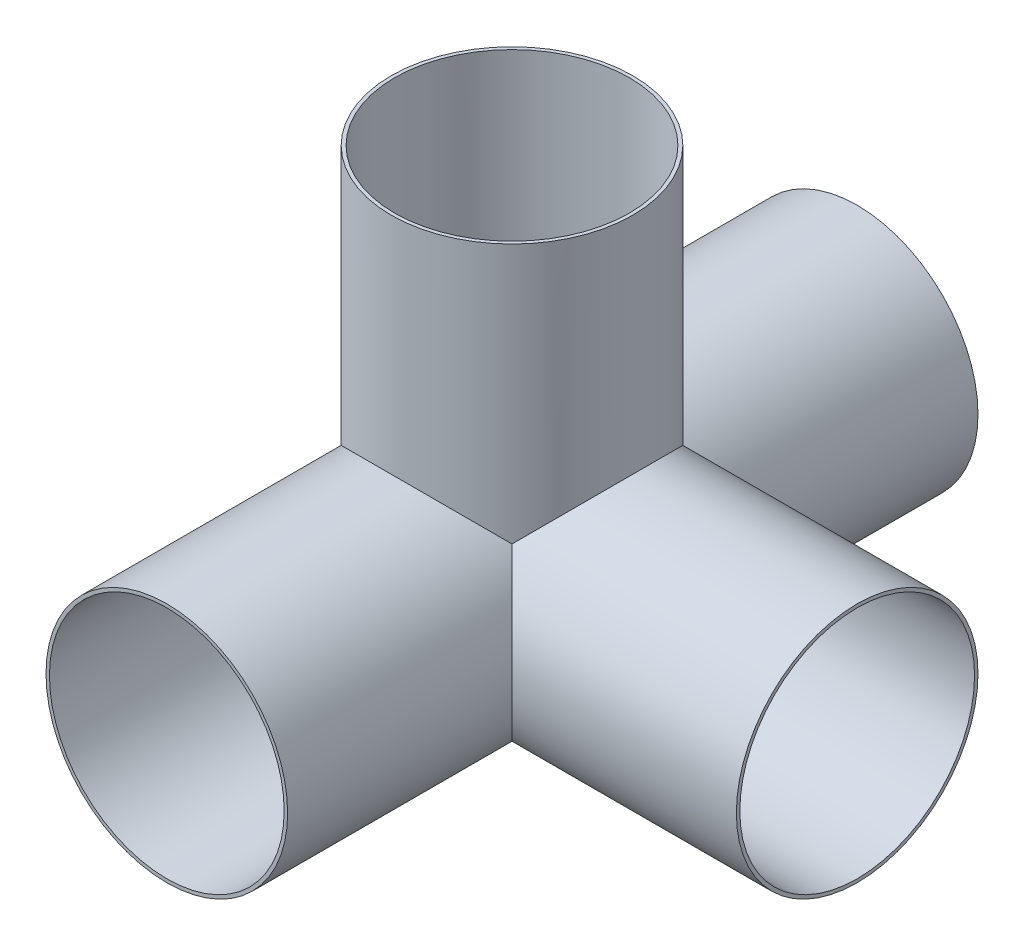
ISO-10303-21;
HEADER;
FILE_DESCRIPTION(('STEP AP214'),'2;1');
FILE_NAME('part.step','',(''),(''),'','','');
FILE_SCHEMA(('AUTOMOTIVE_DESIGN { 1 0 10303 214 1 1 1 1 }'));
ENDSEC;
DATA;
#1=APPLICATION_CONTEXT('core data for automotive mechanical design processes');
#2=APPLICATION_PROTOCOL_DEFINITION('international standard','automotive_design',2000,#1);
#3=PRODUCT_CONTEXT('',#1,'mechanical');
#4=PRODUCT('Part','Part','',(#3));
#5=PRODUCT_RELATED_PRODUCT_CATEGORY('part','',(#4));
#6=PRODUCT_DEFINITION_FORMATION('','',#4);
#7=PRODUCT_DEFINITION_CONTEXT('part definition',#1,'design');
#8=PRODUCT_DEFINITION('design','',#6,#7);
#9=PRODUCT_DEFINITION_SHAPE('','',#8);
#10=(LENGTH_UNIT() NAMED_UNIT(*) SI_UNIT(.MILLI.,.METRE.));
#11=(NAMED_UNIT(*) PLANE_ANGLE_UNIT() SI_UNIT($,.RADIAN.));
#12=(NAMED_UNIT(*) SI_UNIT($,.STERADIAN.) SOLID_ANGLE_UNIT());
#13=UNCERTAINTY_MEASURE_WITH_UNIT(LENGTH_MEASURE(1.E-05),#10,'distance_accuracy_value','');
#14=(GEOMETRIC_REPRESENTATION_CONTEXT(3) GLOBAL_UNCERTAINTY_ASSIGNED_CONTEXT((#13)) GLOBAL_UNIT_ASSIGNED_CONTEXT((#10,
#11,#12)) REPRESENTATION_CONTEXT('',''));
#15=CARTESIAN_POINT('',(0.,0.,0.));
#16=DIRECTION('',(0.,0.,1.));
#17=DIRECTION('',(1.,0.,0.));
#18=AXIS2_PLACEMENT_3D('',#15,#16,#17);
#19=CARTESIAN_POINT('',(0.,0.,0.));
#20=DIRECTION('',(0.,-0.707106781186549,-0.707106781186546));
#21=DIRECTION('',(0.,0.707106781186546,-0.707106781186549));
#22=AXIS2_PLACEMENT_3D('',#19,#20,#21);
#23=PLANE('',#22);
#24=DIRECTION('',(0.577350269189627,0.577350269189625,-0.577350269189626));
#25=VECTOR('',#24,1.);
#26=CARTESIAN_POINT('',(0.,0.,0.));
#27=LINE('',#26,#25);
#28=CARTESIAN_POINT('',(0.,0.,0.));
#29=VERTEX_POINT('',#28);
#30=CARTESIAN_POINT('',(24.7487373415292,24.7487373415292,-24.7487373415292));
#31=VERTEX_POINT('',#30);
#32=EDGE_CURVE('E111',#29,#31,#27,.T.);
#33=ORIENTED_EDGE('',*,*,#32,.F.);
#34=DIRECTION('',(-1.,0.,0.));
#35=VECTOR('',#34,1.);
#36=CARTESIAN_POINT('',(0.,0.,0.));
#37=LINE('',#36,#35);
#38=CARTESIAN_POINT('',(-35.,0.,0.));
#39=VERTEX_POINT('',#38);
#40=EDGE_CURVE('E63',#29,#39,#37,.T.);
#41=ORIENTED_EDGE('',*,*,#40,.T.);
#42=CARTESIAN_POINT('',(0.,0.,0.));
#43=DIRECTION('',(0.,-0.707106781186547,-0.707106781186547));
#44=DIRECTION('',(0.,0.707106781186547,-0.707106781186547));
#45=AXIS2_PLACEMENT_3D('',#42,#43,#44);
#46=ELLIPSE('',#45,49.4974746830583,35.);
#47=EDGE_CURVE('E107',#31,#39,#46,.F.);
#48=ORIENTED_EDGE('',*,*,#47,.F.);
#49=EDGE_LOOP('',(#33,#41,#48));
#50=FACE_BOUND('',#49,.T.);
#51=ADVANCED_FACE('F52',(#50),#23,.T.);
#52=CARTESIAN_POINT('',(0.,0.,0.));
#53=DIRECTION('',(0.707106781186546,-0.707106781186549,0.));
#54=DIRECTION('',(0.707106781186549,0.707106781186546,0.));
#55=AXIS2_PLACEMENT_3D('',#52,#53,#54);
#56=PLANE('',#55);
#57=CARTESIAN_POINT('',(0.,0.,0.));
#58=DIRECTION('',(-0.707106781186547,0.707106781186547,0.));
#59=DIRECTION('',(-0.707106781186547,-0.707106781186547,0.));
#60=AXIS2_PLACEMENT_3D('',#57,#58,#59);
#61=ELLIPSE('',#60,49.4974746830583,35.);
#62=CARTESIAN_POINT('',(24.7487373415292,24.7487373415292,24.7487373415292));
#63=VERTEX_POINT('',#62);
#64=EDGE_CURVE('E98',#63,#31,#61,.T.);
#65=ORIENTED_EDGE('',*,*,#64,.F.);
#66=DIRECTION('',(-0.577350269189627,-0.577350269189625,-0.577350269189626));
#67=VECTOR('',#66,1.);
#68=CARTESIAN_POINT('',(24.7487373415292,24.7487373415291,24.7487373415292));
#69=LINE('',#68,#67);
#70=EDGE_CURVE('E91',#63,#29,#69,.T.);
#71=ORIENTED_EDGE('',*,*,#70,.T.);
#72=ORIENTED_EDGE('',*,*,#32,.T.);
#73=EDGE_LOOP('',(#65,#71,#72));
#74=FACE_BOUND('',#73,.T.);
#75=ADVANCED_FACE('F226',(#74),#56,.T.);
#76=CARTESIAN_POINT('',(0.,0.,0.));
#77=DIRECTION('',(0.,0.,1.));
#78=DIRECTION('',(1.,0.,0.));
#79=AXIS2_PLACEMENT_3D('',#76,#77,#78);
#80=PLANE('',#79);
#81=DIRECTION('',(0.,-1.,0.));
#82=VECTOR('',#81,1.);
#83=CARTESIAN_POINT('',(0.,0.,0.));
#84=LINE('',#83,#82);
#85=CARTESIAN_POINT('',(0.,-35.,0.));
#86=VERTEX_POINT('',#85);
#87=EDGE_CURVE('E12',#29,#86,#84,.T.);
#88=ORIENTED_EDGE('',*,*,#87,.T.);
#89=CARTESIAN_POINT('',(0.,0.,0.));
#90=DIRECTION('',(0.,0.,1.));
#91=DIRECTION('',(1.,0.,0.));
#92=AXIS2_PLACEMENT_3D('',#89,#90,#91);
#93=CIRCLE('',#92,35.);
#94=EDGE_CURVE('E86',#39,#86,#93,.T.);
#95=ORIENTED_EDGE('',*,*,#94,.F.);
#96=ORIENTED_EDGE('',*,*,#40,.F.);
#97=EDGE_LOOP('',(#88,#95,#96));
#98=FACE_BOUND('',#97,.T.);
#99=ADVANCED_FACE('F84',(#98),#80,.F.);
#100=CARTESIAN_POINT('',(0.,0.,0.));
#101=DIRECTION('',(-0.707106781186549,0.,0.707106781186546));
#102=DIRECTION('',(0.707106781186546,0.,0.707106781186549));
#103=AXIS2_PLACEMENT_3D('',#100,#101,#102);
#104=PLANE('',#103);
#105=ORIENTED_EDGE('',*,*,#70,.F.);
#106=CARTESIAN_POINT('',(0.,0.,0.));
#107=DIRECTION('',(0.707106781186547,0.,-0.707106781186547));
#108=DIRECTION('',(-0.707106781186547,0.,-0.707106781186547));
#109=AXIS2_PLACEMENT_3D('',#106,#107,#108);
#110=ELLIPSE('',#109,49.4974746830583,35.);
#111=EDGE_CURVE('E56',#63,#86,#110,.T.);
#112=ORIENTED_EDGE('',*,*,#111,.T.);
#113=ORIENTED_EDGE('',*,*,#87,.F.);
#114=EDGE_LOOP('',(#105,#112,#113));
#115=FACE_BOUND('',#114,.T.);
#116=ADVANCED_FACE('F90',(#115),#104,.F.);
#117=CARTESIAN_POINT('',(0.,0.,100.));
#118=DIRECTION('',(0.,0.,1.));
#119=DIRECTION('',(1.,0.,0.));
#120=AXIS2_PLACEMENT_3D('',#117,#118,#119);
#121=PLANE('',#120);
#122=CARTESIAN_POINT('',(0.,0.,100.));
#123=DIRECTION('',(0.,0.,1.));
#124=DIRECTION('',(1.,0.,0.));
#125=AXIS2_PLACEMENT_3D('',#122,#123,#124);
#126=CIRCLE('',#125,34.);
#127=CARTESIAN_POINT('',(34.,0.,100.));
#128=VERTEX_POINT('',#127);
#129=EDGE_CURVE('E129',#128,#128,#126,.T.);
#130=ORIENTED_EDGE('',*,*,#129,.F.);
#131=EDGE_LOOP('',(#130));
#132=FACE_BOUND('',#131,.T.);
#133=CARTESIAN_POINT('',(0.,0.,100.));
#134=DIRECTION('',(0.,0.,1.));
#135=DIRECTION('',(1.,0.,0.));
#136=AXIS2_PLACEMENT_3D('',#133,#134,#135);
#137=CIRCLE('',#136,35.);
#138=CARTESIAN_POINT('',(35.,0.,100.));
#139=VERTEX_POINT('',#138);
#140=EDGE_CURVE('E104',#139,#139,#137,.T.);
#141=ORIENTED_EDGE('',*,*,#140,.T.);
#142=EDGE_LOOP('',(#141));
#143=FACE_BOUND('',#142,.T.);
#144=ADVANCED_FACE('F215',(#132,#143),#121,.T.);
#145=CARTESIAN_POINT('',(0.,0.,100.));
#146=DIRECTION('',(0.,0.,-1.));
#147=DIRECTION('',(-1.,0.,0.));
#148=AXIS2_PLACEMENT_3D('',#145,#146,#147);
#149=CYLINDRICAL_SURFACE('',#148,35.);
#150=ORIENTED_EDGE('',*,*,#140,.F.);
#151=EDGE_LOOP('',(#150));
#152=FACE_BOUND('',#151,.T.);
#153=CARTESIAN_POINT('',(0.,0.,0.));
#154=DIRECTION('',(0.,0.707106781186547,-0.707106781186547));
#155=DIRECTION('',(0.,-0.707106781186547,-0.707106781186547));
#156=AXIS2_PLACEMENT_3D('',#153,#154,#155);
#157=ELLIPSE('',#156,49.4974746830583,35.);
#158=EDGE_CURVE('E96',#39,#63,#157,.T.);
#159=ORIENTED_EDGE('',*,*,#158,.F.);
#160=ORIENTED_EDGE('',*,*,#94,.T.);
#161=ORIENTED_EDGE('',*,*,#111,.F.);
#162=EDGE_LOOP('',(#159,#160,#161));
#163=FACE_BOUND('',#162,.T.);
#164=ADVANCED_FACE('F54',(#152,#163),#149,.T.);
#165=CARTESIAN_POINT('',(0.,100.,0.));
#166=DIRECTION('',(0.,1.,0.));
#167=DIRECTION('',(0.,0.,1.));
#168=AXIS2_PLACEMENT_3D('',#165,#166,#167);
#169=PLANE('',#168);
#170=CARTESIAN_POINT('',(0.,100.,0.));
#171=DIRECTION('',(0.,1.,0.));
#172=DIRECTION('',(0.,0.,1.));
#173=AXIS2_PLACEMENT_3D('',#170,#171,#172);
#174=CIRCLE('',#173,34.);
#175=CARTESIAN_POINT('',(0.,100.,34.));
#176=VERTEX_POINT('',#175);
#177=EDGE_CURVE('E124',#176,#176,#174,.T.);
#178=ORIENTED_EDGE('',*,*,#177,.F.);
#179=EDGE_LOOP('',(#178));
#180=FACE_BOUND('',#179,.T.);
#181=CARTESIAN_POINT('',(0.,100.,0.));
#182=DIRECTION('',(0.,1.,0.));
#183=DIRECTION('',(0.,0.,1.));
#184=AXIS2_PLACEMENT_3D('',#181,#182,#183);
#185=CIRCLE('',#184,35.);
#186=CARTESIAN_POINT('',(0.,100.,35.));
#187=VERTEX_POINT('',#186);
#188=EDGE_CURVE('E114',#187,#187,#185,.T.);
#189=ORIENTED_EDGE('',*,*,#188,.T.);
#190=EDGE_LOOP('',(#189));
#191=FACE_BOUND('',#190,.T.);
#192=ADVANCED_FACE('F223',(#180,#191),#169,.T.);
#193=CARTESIAN_POINT('',(0.,100.,0.));
#194=DIRECTION('',(0.,-1.,0.));
#195=DIRECTION('',(0.,0.,-1.));
#196=AXIS2_PLACEMENT_3D('',#193,#194,#195);
#197=CYLINDRICAL_SURFACE('',#196,35.);
#198=ORIENTED_EDGE('',*,*,#188,.F.);
#199=EDGE_LOOP('',(#198));
#200=FACE_BOUND('',#199,.T.);
#201=ORIENTED_EDGE('',*,*,#64,.T.);
#202=ORIENTED_EDGE('',*,*,#47,.T.);
#203=ORIENTED_EDGE('',*,*,#158,.T.);
#204=EDGE_LOOP('',(#201,#202,#203));
#205=FACE_BOUND('',#204,.T.);
#206=ADVANCED_FACE('F231',(#200,#205),#197,.T.);
#207=CARTESIAN_POINT('',(0.,0.707106781186549,0.707106781186546));
#208=DIRECTION('',(0.,-0.707106781186549,-0.707106781186546));
#209=DIRECTION('',(0.,0.707106781186546,-0.707106781186549));
#210=AXIS2_PLACEMENT_3D('',#207,#208,#209);
#211=PLANE('',#210);
#212=DIRECTION('',(0.577350269189626,0.577350269189624,-0.577350269189626));
#213=VECTOR('',#212,1.);
#214=CARTESIAN_POINT('',(-0.47140452079103,0.942809041582064,0.47140452079103));
#215=LINE('',#214,#213);
#216=CARTESIAN_POINT('',(-0.707106781186548,0.707106781186547,0.707106781186547));
#217=VERTEX_POINT('',#216);
#218=CARTESIAN_POINT('',(24.0416305603426,25.4558441227156,-24.0416305603426));
#219=VERTEX_POINT('',#218);
#220=EDGE_CURVE('E127',#217,#219,#215,.T.);
#221=ORIENTED_EDGE('',*,*,#220,.T.);
#222=CARTESIAN_POINT('',(0.,1.41421356237309,0.));
#223=DIRECTION('',(0.,-0.707106781186549,-0.707106781186546));
#224=DIRECTION('',(0.,-0.707106781186546,0.707106781186549));
#225=AXIS2_PLACEMENT_3D('',#222,#223,#224);
#226=ELLIPSE('',#225,48.0832611206852,34.);
#227=CARTESIAN_POINT('',(-33.9926462635671,0.707106781186547,0.707106781186547));
#228=VERTEX_POINT('',#227);
#229=EDGE_CURVE('E132',#219,#228,#226,.F.);
#230=ORIENTED_EDGE('',*,*,#229,.T.);
#231=CARTESIAN_POINT('',(0.,0.,1.41421356237309));
#232=DIRECTION('',(0.,-0.707106781186549,-0.707106781186546));
#233=DIRECTION('',(0.,0.707106781186546,-0.707106781186549));
#234=AXIS2_PLACEMENT_3D('',#231,#232,#233);
#235=ELLIPSE('',#234,48.0832611206853,34.);
#236=CARTESIAN_POINT('',(-33.9974767758542,0.414213562373096,1.));
#237=VERTEX_POINT('',#236);
#238=EDGE_CURVE('E94',#237,#228,#235,.T.);
#239=ORIENTED_EDGE('',*,*,#238,.F.);
#240=DIRECTION('',(-1.,0.,0.));
#241=VECTOR('',#240,1.);
#242=CARTESIAN_POINT('',(0.,0.414213562373096,1.));
#243=LINE('',#242,#241);
#244=CARTESIAN_POINT('',(-0.414213562373096,0.414213562373096,1.));
#245=VERTEX_POINT('',#244);
#246=EDGE_CURVE('E152',#245,#237,#243,.T.);
#247=ORIENTED_EDGE('',*,*,#246,.F.);
#248=DIRECTION('',(0.577350269189625,-0.577350269189625,0.577350269189627));
#249=VECTOR('',#248,1.);
#250=CARTESIAN_POINT('',(-0.471404520791033,0.471404520791033,0.942809041582063));
#251=LINE('',#250,#249);
#252=EDGE_CURVE('E136',#217,#245,#251,.T.);
#253=ORIENTED_EDGE('',*,*,#252,.F.);
#254=EDGE_LOOP('',(#221,#230,#239,#247,#253));
#255=FACE_BOUND('',#254,.T.);
#256=ADVANCED_FACE('F176',(#255),#211,.F.);
#257=CARTESIAN_POINT('',(-0.707106781186546,0.707106781186549,0.));
#258=DIRECTION('',(0.707106781186546,-0.707106781186549,0.));
#259=DIRECTION('',(0.707106781186549,0.707106781186546,0.));
#260=AXIS2_PLACEMENT_3D('',#257,#258,#259);
#261=PLANE('',#260);
#262=CARTESIAN_POINT('',(0.,1.41421356237309,0.));
#263=DIRECTION('',(0.707106781186546,-0.707106781186549,0.));
#264=DIRECTION('',(-0.707106781186549,-0.707106781186546,0.));
#265=AXIS2_PLACEMENT_3D('',#262,#263,#264);
#266=ELLIPSE('',#265,48.0832611206852,34.);
#267=CARTESIAN_POINT('',(23.3241229002093,24.7383364625823,24.7383364625824));
#268=VERTEX_POINT('',#267);
#269=EDGE_CURVE('E133',#268,#219,#266,.F.);
#270=ORIENTED_EDGE('',*,*,#269,.T.);
#271=ORIENTED_EDGE('',*,*,#220,.F.);
#272=DIRECTION('',(-0.577350269189626,-0.577350269189624,-0.577350269189628));
#273=VECTOR('',#272,1.);
#274=CARTESIAN_POINT('',(-0.942809041582063,0.471404520791033,0.471404520791031));
#275=LINE('',#274,#273);
#276=EDGE_CURVE('E153',#268,#217,#275,.T.);
#277=ORIENTED_EDGE('',*,*,#276,.F.);
#278=EDGE_LOOP('',(#270,#271,#277));
#279=FACE_BOUND('',#278,.T.);
#280=ADVANCED_FACE('F189',(#279),#261,.F.);
#281=CARTESIAN_POINT('',(0.,0.,1.));
#282=DIRECTION('',(0.,0.,1.));
#283=DIRECTION('',(1.,0.,0.));
#284=AXIS2_PLACEMENT_3D('',#281,#282,#283);
#285=PLANE('',#284);
#286=DIRECTION('',(0.,-1.,0.));
#287=VECTOR('',#286,1.);
#288=CARTESIAN_POINT('',(-0.414213562373096,0.,1.));
#289=LINE('',#288,#287);
#290=CARTESIAN_POINT('',(-0.414213562373096,-33.9974767758542,1.));
#291=VERTEX_POINT('',#290);
#292=EDGE_CURVE('E139',#245,#291,#289,.T.);
#293=ORIENTED_EDGE('',*,*,#292,.F.);
#294=ORIENTED_EDGE('',*,*,#246,.T.);
#295=CARTESIAN_POINT('',(0.,0.,1.));
#296=DIRECTION('',(0.,0.,1.));
#297=DIRECTION('',(1.,0.,0.));
#298=AXIS2_PLACEMENT_3D('',#295,#296,#297);
#299=CIRCLE('',#298,34.);
#300=EDGE_CURVE('E145',#237,#291,#299,.T.);
#301=ORIENTED_EDGE('',*,*,#300,.T.);
#302=EDGE_LOOP('',(#293,#294,#301));
#303=FACE_BOUND('',#302,.T.);
#304=ADVANCED_FACE('F200',(#303),#285,.T.);
#305=CARTESIAN_POINT('',(-0.707106781186549,0.,0.707106781186546));
#306=DIRECTION('',(-0.707106781186549,0.,0.707106781186546));
#307=DIRECTION('',(0.707106781186546,0.,0.707106781186549));
#308=AXIS2_PLACEMENT_3D('',#305,#306,#307);
#309=PLANE('',#308);
#310=ORIENTED_EDGE('',*,*,#276,.T.);
#311=ORIENTED_EDGE('',*,*,#252,.T.);
#312=ORIENTED_EDGE('',*,*,#292,.T.);
#313=CARTESIAN_POINT('',(0.,0.,1.41421356237309));
#314=DIRECTION('',(-0.707106781186549,0.,0.707106781186546));
#315=DIRECTION('',(-0.707106781186546,0.,-0.707106781186549));
#316=AXIS2_PLACEMENT_3D('',#313,#314,#315);
#317=ELLIPSE('',#316,48.0832611206853,34.);
#318=EDGE_CURVE('E142',#268,#291,#317,.F.);
#319=ORIENTED_EDGE('',*,*,#318,.F.);
#320=EDGE_LOOP('',(#310,#311,#312,#319));
#321=FACE_BOUND('',#320,.T.);
#322=ADVANCED_FACE('F193',(#321),#309,.T.);
#323=CARTESIAN_POINT('',(0.,0.,100.));
#324=DIRECTION('',(0.,0.,-1.));
#325=DIRECTION('',(-1.,0.,0.));
#326=AXIS2_PLACEMENT_3D('',#323,#324,#325);
#327=CYLINDRICAL_SURFACE('',#326,34.);
#328=ORIENTED_EDGE('',*,*,#129,.T.);
#329=EDGE_LOOP('',(#328));
#330=FACE_BOUND('',#329,.T.);
#331=CARTESIAN_POINT('',(0.,0.,0.));
#332=DIRECTION('',(0.,0.707106781186547,-0.707106781186547));
#333=DIRECTION('',(0.,-0.707106781186547,-0.707106781186547));
#334=AXIS2_PLACEMENT_3D('',#331,#332,#333);
#335=ELLIPSE('',#334,48.0832611206852,34.);
#336=EDGE_CURVE('E128',#228,#268,#335,.T.);
#337=ORIENTED_EDGE('',*,*,#336,.T.);
#338=ORIENTED_EDGE('',*,*,#318,.T.);
#339=ORIENTED_EDGE('',*,*,#300,.F.);
#340=ORIENTED_EDGE('',*,*,#238,.T.);
#341=EDGE_LOOP('',(#337,#338,#339,#340));
#342=FACE_BOUND('',#341,.T.);
#343=ADVANCED_FACE('F197',(#330,#342),#327,.F.);
#344=CARTESIAN_POINT('',(0.,100.,0.));
#345=DIRECTION('',(0.,-1.,0.));
#346=DIRECTION('',(0.,0.,-1.));
#347=AXIS2_PLACEMENT_3D('',#344,#345,#346);
#348=CYLINDRICAL_SURFACE('',#347,34.);
#349=ORIENTED_EDGE('',*,*,#177,.T.);
#350=EDGE_LOOP('',(#349));
#351=FACE_BOUND('',#350,.T.);
#352=ORIENTED_EDGE('',*,*,#269,.F.);
#353=ORIENTED_EDGE('',*,*,#336,.F.);
#354=ORIENTED_EDGE('',*,*,#229,.F.);
#355=EDGE_LOOP('',(#352,#353,#354));
#356=FACE_BOUND('',#355,.T.);
#357=ADVANCED_FACE('F187',(#351,#356),#348,.F.);
#358=CLOSED_SHELL('',(#51,#75,#99,#116,#144,#164,#192,#206,#256,#280,#304,#322,#343,#357));
#359=MANIFOLD_SOLID_BREP('B2',#358);
#360=CARTESIAN_POINT('',(0.,0.,0.));
#361=DIRECTION('',(0.,0.,1.));
#362=DIRECTION('',(1.,0.,0.));
#363=AXIS2_PLACEMENT_3D('',#360,#361,#362);
#364=PLANE('',#363);
#365=DIRECTION('',(0.,-1.,0.));
#366=VECTOR('',#365,1.);
#367=CARTESIAN_POINT('',(0.,0.,0.));
#368=LINE('',#367,#366);
#369=CARTESIAN_POINT('',(0.,0.,0.));
#370=VERTEX_POINT('',#369);
#371=CARTESIAN_POINT('',(0.,-35.,0.));
#372=VERTEX_POINT('',#371);
#373=EDGE_CURVE('E50',#370,#372,#368,.T.);
#374=ORIENTED_EDGE('',*,*,#373,.F.);
#375=DIRECTION('',(-1.,0.,0.));
#376=VECTOR('',#375,1.);
#377=CARTESIAN_POINT('',(0.,0.,0.));
#378=LINE('',#377,#376);
#379=CARTESIAN_POINT('',(-35.,0.,0.));
#380=VERTEX_POINT('',#379);
#381=EDGE_CURVE('E424',#370,#380,#378,.T.);
#382=ORIENTED_EDGE('',*,*,#381,.T.);
#383=CARTESIAN_POINT('',(0.,0.,0.));
#384=DIRECTION('',(0.,0.,1.));
#385=DIRECTION('',(1.,0.,0.));
#386=AXIS2_PLACEMENT_3D('',#383,#384,#385);
#387=CIRCLE('',#386,35.);
#388=EDGE_CURVE('E522',#380,#372,#387,.T.);
#389=ORIENTED_EDGE('',*,*,#388,.T.);
#390=EDGE_LOOP('',(#374,#382,#389));
#391=FACE_BOUND('',#390,.T.);
#392=ADVANCED_FACE('F417',(#391),#364,.T.);
#393=CARTESIAN_POINT('',(0.,0.,0.));
#394=DIRECTION('',(-0.707106781186549,0.,0.707106781186546));
#395=DIRECTION('',(0.707106781186546,0.,0.707106781186549));
#396=AXIS2_PLACEMENT_3D('',#393,#394,#395);
#397=PLANE('',#396);
#398=DIRECTION('',(-0.577350269189627,-0.577350269189625,-0.577350269189626));
#399=VECTOR('',#398,1.);
#400=CARTESIAN_POINT('',(24.7487373415292,24.7487373415291,24.7487373415292));
#401=LINE('',#400,#399);
#402=CARTESIAN_POINT('',(24.7487373415292,24.7487373415292,24.7487373415292));
#403=VERTEX_POINT('',#402);
#404=EDGE_CURVE('E526',#403,#370,#401,.T.);
#405=ORIENTED_EDGE('',*,*,#404,.T.);
#406=ORIENTED_EDGE('',*,*,#373,.T.);
#407=CARTESIAN_POINT('',(0.,0.,0.));
#408=DIRECTION('',(0.707106781186547,0.,-0.707106781186547));
#409=DIRECTION('',(-0.707106781186547,0.,-0.707106781186547));
#410=AXIS2_PLACEMENT_3D('',#407,#408,#409);
#411=ELLIPSE('',#410,49.4974746830583,35.);
#412=EDGE_CURVE('E515',#403,#372,#411,.T.);
#413=ORIENTED_EDGE('',*,*,#412,.F.);
#414=EDGE_LOOP('',(#405,#406,#413));
#415=FACE_BOUND('',#414,.T.);
#416=ADVANCED_FACE('F555',(#415),#397,.T.);
#417=CARTESIAN_POINT('',(0.,0.,0.));
#418=DIRECTION('',(0.,-0.707106781186549,-0.707106781186546));
#419=DIRECTION('',(0.,0.707106781186546,-0.707106781186549));
#420=AXIS2_PLACEMENT_3D('',#417,#418,#419);
#421=PLANE('',#420);
#422=DIRECTION('',(0.577350269189627,0.577350269189625,-0.577350269189626));
#423=VECTOR('',#422,1.);
#424=CARTESIAN_POINT('',(0.,0.,0.));
#425=LINE('',#424,#423);
#426=CARTESIAN_POINT('',(24.7487373415292,24.7487373415292,-24.7487373415292));
#427=VERTEX_POINT('',#426);
#428=EDGE_CURVE('E508',#370,#427,#425,.T.);
#429=ORIENTED_EDGE('',*,*,#428,.T.);
#430=CARTESIAN_POINT('',(0.,0.,0.));
#431=DIRECTION('',(0.,-0.707106781186547,-0.707106781186547));
#432=DIRECTION('',(0.,0.707106781186547,-0.707106781186547));
#433=AXIS2_PLACEMENT_3D('',#430,#431,#432);
#434=ELLIPSE('',#433,49.4974746830583,35.);
#435=EDGE_CURVE('E437',#427,#380,#434,.F.);
#436=ORIENTED_EDGE('',*,*,#435,.T.);
#437=ORIENTED_EDGE('',*,*,#381,.F.);
#438=EDGE_LOOP('',(#429,#436,#437));
#439=FACE_BOUND('',#438,.T.);
#440=ADVANCED_FACE('F530',(#439),#421,.F.);
#441=CARTESIAN_POINT('',(0.,0.,0.));
#442=DIRECTION('',(0.707106781186546,-0.707106781186549,0.));
#443=DIRECTION('',(0.707106781186549,0.707106781186546,0.));
#444=AXIS2_PLACEMENT_3D('',#441,#442,#443);
#445=PLANE('',#444);
#446=CARTESIAN_POINT('',(0.,0.,0.));
#447=DIRECTION('',(-0.707106781186547,0.707106781186547,0.));
#448=DIRECTION('',(-0.707106781186547,-0.707106781186547,0.));
#449=AXIS2_PLACEMENT_3D('',#446,#447,#448);
#450=ELLIPSE('',#449,49.4974746830583,35.);
#451=EDGE_CURVE('E509',#403,#427,#450,.T.);
#452=ORIENTED_EDGE('',*,*,#451,.T.);
#453=ORIENTED_EDGE('',*,*,#428,.F.);
#454=ORIENTED_EDGE('',*,*,#404,.F.);
#455=EDGE_LOOP('',(#452,#453,#454));
#456=FACE_BOUND('',#455,.T.);
#457=ADVANCED_FACE('F535',(#456),#445,.F.);
#458=CARTESIAN_POINT('',(0.,0.,100.));
#459=DIRECTION('',(0.,0.,-1.));
#460=DIRECTION('',(-1.,0.,0.));
#461=AXIS2_PLACEMENT_3D('',#458,#459,#460);
#462=CYLINDRICAL_SURFACE('',#461,35.);
#463=CARTESIAN_POINT('',(0.,0.,-100.));
#464=DIRECTION('',(0.,0.,1.));
#465=DIRECTION('',(1.,0.,0.));
#466=AXIS2_PLACEMENT_3D('',#463,#464,#465);
#467=CIRCLE('',#466,35.);
#468=CARTESIAN_POINT('',(35.,0.,-100.));
#469=VERTEX_POINT('',#468);
#470=EDGE_CURVE('E512',#469,#469,#467,.T.);
#471=ORIENTED_EDGE('',*,*,#470,.T.);
#472=EDGE_LOOP('',(#471));
#473=FACE_BOUND('',#472,.T.);
#474=ORIENTED_EDGE('',*,*,#388,.F.);
#475=ORIENTED_EDGE('',*,*,#435,.F.);
#476=CARTESIAN_POINT('',(0.,0.,0.));
#477=DIRECTION('',(-0.707106781186547,0.,-0.707106781186547));
#478=DIRECTION('',(0.707106781186547,0.,-0.707106781186547));
#479=AXIS2_PLACEMENT_3D('',#476,#477,#478);
#480=ELLIPSE('',#479,49.4974746830583,35.);
#481=EDGE_CURVE('E519',#372,#427,#480,.F.);
#482=ORIENTED_EDGE('',*,*,#481,.F.);
#483=EDGE_LOOP('',(#474,#475,#482));
#484=FACE_BOUND('',#483,.T.);
#485=ADVANCED_FACE('F538',(#473,#484),#462,.T.);
#486=CARTESIAN_POINT('',(100.,0.,0.));
#487=DIRECTION('',(-1.,0.,0.));
#488=DIRECTION('',(0.,0.,1.));
#489=AXIS2_PLACEMENT_3D('',#486,#487,#488);
#490=CYLINDRICAL_SURFACE('',#489,35.);
#491=CARTESIAN_POINT('',(100.,0.,0.));
#492=DIRECTION('',(1.,0.,0.));
#493=DIRECTION('',(0.,0.,-1.));
#494=AXIS2_PLACEMENT_3D('',#491,#492,#493);
#495=CIRCLE('',#494,35.);
#496=CARTESIAN_POINT('',(100.,0.,-35.));
#497=VERTEX_POINT('',#496);
#498=EDGE_CURVE('E494',#497,#497,#495,.T.);
#499=ORIENTED_EDGE('',*,*,#498,.F.);
#500=EDGE_LOOP('',(#499));
#501=FACE_BOUND('',#500,.T.);
#502=ORIENTED_EDGE('',*,*,#451,.F.);
#503=ORIENTED_EDGE('',*,*,#412,.T.);
#504=ORIENTED_EDGE('',*,*,#481,.T.);
#505=EDGE_LOOP('',(#502,#503,#504));
#506=FACE_BOUND('',#505,.T.);
#507=ADVANCED_FACE('F537',(#501,#506),#490,.T.);
#508=CARTESIAN_POINT('',(0.,0.,-100.));
#509=DIRECTION('',(0.,0.,1.));
#510=DIRECTION('',(1.,0.,0.));
#511=AXIS2_PLACEMENT_3D('',#508,#509,#510);
#512=PLANE('',#511);
#513=CARTESIAN_POINT('',(0.,0.,-100.));
#514=DIRECTION('',(0.,0.,1.));
#515=DIRECTION('',(1.,0.,0.));
#516=AXIS2_PLACEMENT_3D('',#513,#514,#515);
#517=CIRCLE('',#516,34.);
#518=CARTESIAN_POINT('',(34.,0.,-100.));
#519=VERTEX_POINT('',#518);
#520=EDGE_CURVE('E500',#519,#519,#517,.T.);
#521=ORIENTED_EDGE('',*,*,#520,.T.);
#522=EDGE_LOOP('',(#521));
#523=FACE_BOUND('',#522,.T.);
#524=ORIENTED_EDGE('',*,*,#470,.F.);
#525=EDGE_LOOP('',(#524));
#526=FACE_BOUND('',#525,.T.);
#527=ADVANCED_FACE('F546',(#523,#526),#512,.F.);
#528=CARTESIAN_POINT('',(100.,0.,0.));
#529=DIRECTION('',(1.,0.,0.));
#530=DIRECTION('',(0.,0.,-1.));
#531=AXIS2_PLACEMENT_3D('',#528,#529,#530);
#532=PLANE('',#531);
#533=CARTESIAN_POINT('',(100.,0.,0.));
#534=DIRECTION('',(1.,0.,0.));
#535=DIRECTION('',(0.,0.,-1.));
#536=AXIS2_PLACEMENT_3D('',#533,#534,#535);
#537=CIRCLE('',#536,34.);
#538=CARTESIAN_POINT('',(100.,0.,-34.));
#539=VERTEX_POINT('',#538);
#540=EDGE_CURVE('E504',#539,#539,#537,.T.);
#541=ORIENTED_EDGE('',*,*,#540,.F.);
#542=EDGE_LOOP('',(#541));
#543=FACE_BOUND('',#542,.T.);
#544=ORIENTED_EDGE('',*,*,#498,.T.);
#545=EDGE_LOOP('',(#544));
#546=FACE_BOUND('',#545,.T.);
#547=ADVANCED_FACE('F550',(#543,#546),#532,.T.);
#548=CARTESIAN_POINT('',(0.,0.,-1.));
#549=DIRECTION('',(0.,0.,1.));
#550=DIRECTION('',(1.,0.,0.));
#551=AXIS2_PLACEMENT_3D('',#548,#549,#550);
#552=PLANE('',#551);
#553=DIRECTION('',(0.,-1.,0.));
#554=VECTOR('',#553,1.);
#555=CARTESIAN_POINT('',(0.414213562373096,0.,-1.));
#556=LINE('',#555,#554);
#557=CARTESIAN_POINT('',(0.414213562373096,-0.414213562373096,-1.));
#558=VERTEX_POINT('',#557);
#559=CARTESIAN_POINT('',(0.414213562373096,-33.9974767758542,-1.));
#560=VERTEX_POINT('',#559);
#561=EDGE_CURVE('E472',#558,#560,#556,.T.);
#562=ORIENTED_EDGE('',*,*,#561,.T.);
#563=CARTESIAN_POINT('',(0.,0.,-1.));
#564=DIRECTION('',(0.,0.,1.));
#565=DIRECTION('',(1.,0.,0.));
#566=AXIS2_PLACEMENT_3D('',#563,#564,#565);
#567=CIRCLE('',#566,34.);
#568=CARTESIAN_POINT('',(-33.9974767758542,-0.414213562373096,-1.));
#569=VERTEX_POINT('',#568);
#570=EDGE_CURVE('E474',#569,#560,#567,.T.);
#571=ORIENTED_EDGE('',*,*,#570,.F.);
#572=DIRECTION('',(-1.,0.,0.));
#573=VECTOR('',#572,1.);
#574=CARTESIAN_POINT('',(0.,-0.414213562373096,-1.));
#575=LINE('',#574,#573);
#576=EDGE_CURVE('E469',#558,#569,#575,.T.);
#577=ORIENTED_EDGE('',*,*,#576,.F.);
#578=EDGE_LOOP('',(#562,#571,#577));
#579=FACE_BOUND('',#578,.T.);
#580=ADVANCED_FACE('F471',(#579),#552,.F.);
#581=CARTESIAN_POINT('',(0.707106781186549,0.,-0.707106781186546));
#582=DIRECTION('',(-0.707106781186549,0.,0.707106781186546));
#583=DIRECTION('',(0.707106781186546,0.,0.707106781186549));
#584=AXIS2_PLACEMENT_3D('',#581,#582,#583);
#585=PLANE('',#584);
#586=DIRECTION('',(-0.577350269189626,-0.577350269189624,-0.577350269189628));
#587=VECTOR('',#586,1.);
#588=CARTESIAN_POINT('',(0.942809041582063,-0.471404520791033,-0.471404520791031));
#589=LINE('',#588,#587);
#590=CARTESIAN_POINT('',(25.4558441227157,24.0416305603425,24.0416305603427));
#591=VERTEX_POINT('',#590);
#592=CARTESIAN_POINT('',(0.707106781186547,-0.707106781186548,-0.707106781186547));
#593=VERTEX_POINT('',#592);
#594=EDGE_CURVE('E478',#591,#593,#589,.T.);
#595=ORIENTED_EDGE('',*,*,#594,.F.);
#596=CARTESIAN_POINT('',(1.41421356237309,0.,0.));
#597=DIRECTION('',(-0.707106781186549,0.,0.707106781186546));
#598=DIRECTION('',(-0.707106781186546,0.,-0.707106781186549));
#599=AXIS2_PLACEMENT_3D('',#596,#597,#598);
#600=ELLIPSE('',#599,48.0832611206852,34.);
#601=CARTESIAN_POINT('',(0.707106781186547,-33.9926462635671,-0.707106781186547));
#602=VERTEX_POINT('',#601);
#603=EDGE_CURVE('E503',#591,#602,#600,.F.);
#604=ORIENTED_EDGE('',*,*,#603,.T.);
#605=CARTESIAN_POINT('',(0.,0.,-1.4142135623731));
#606=DIRECTION('',(-0.707106781186549,0.,0.707106781186546));
#607=DIRECTION('',(-0.707106781186546,0.,-0.707106781186549));
#608=AXIS2_PLACEMENT_3D('',#605,#606,#607);
#609=ELLIPSE('',#608,48.0832611206853,34.);
#610=EDGE_CURVE('E487',#560,#602,#609,.T.);
#611=ORIENTED_EDGE('',*,*,#610,.F.);
#612=ORIENTED_EDGE('',*,*,#561,.F.);
#613=DIRECTION('',(-0.577350269189625,0.577350269189625,-0.577350269189627));
#614=VECTOR('',#613,1.);
#615=CARTESIAN_POINT('',(0.471404520791033,-0.471404520791033,-0.942809041582063));
#616=LINE('',#615,#614);
#617=EDGE_CURVE('E483',#593,#558,#616,.T.);
#618=ORIENTED_EDGE('',*,*,#617,.F.);
#619=EDGE_LOOP('',(#595,#604,#611,#612,#618));
#620=FACE_BOUND('',#619,.T.);
#621=ADVANCED_FACE('F482',(#620),#585,.F.);
#622=CARTESIAN_POINT('',(0.,-0.707106781186549,-0.707106781186546));
#623=DIRECTION('',(0.,-0.707106781186549,-0.707106781186546));
#624=DIRECTION('',(0.,0.707106781186546,-0.707106781186549));
#625=AXIS2_PLACEMENT_3D('',#622,#623,#624);
#626=PLANE('',#625);
#627=DIRECTION('',(0.577350269189626,0.577350269189624,-0.577350269189626));
#628=VECTOR('',#627,1.);
#629=CARTESIAN_POINT('',(0.47140452079103,-0.942809041582064,-0.47140452079103));
#630=LINE('',#629,#628);
#631=CARTESIAN_POINT('',(24.7383364625824,23.3241229002092,-24.7383364625824));
#632=VERTEX_POINT('',#631);
#633=EDGE_CURVE('E492',#593,#632,#630,.T.);
#634=ORIENTED_EDGE('',*,*,#633,.F.);
#635=ORIENTED_EDGE('',*,*,#617,.T.);
#636=ORIENTED_EDGE('',*,*,#576,.T.);
#637=CARTESIAN_POINT('',(0.,0.,-1.4142135623731));
#638=DIRECTION('',(0.,-0.707106781186549,-0.707106781186546));
#639=DIRECTION('',(0.,0.707106781186546,-0.707106781186549));
#640=AXIS2_PLACEMENT_3D('',#637,#638,#639);
#641=ELLIPSE('',#640,48.0832611206853,34.);
#642=EDGE_CURVE('E668',#632,#569,#641,.F.);
#643=ORIENTED_EDGE('',*,*,#642,.F.);
#644=EDGE_LOOP('',(#634,#635,#636,#643));
#645=FACE_BOUND('',#644,.T.);
#646=ADVANCED_FACE('F490',(#645),#626,.T.);
#647=CARTESIAN_POINT('',(0.707106781186546,-0.707106781186549,0.));
#648=DIRECTION('',(0.707106781186546,-0.707106781186549,0.));
#649=DIRECTION('',(0.707106781186549,0.707106781186546,0.));
#650=AXIS2_PLACEMENT_3D('',#647,#648,#649);
#651=PLANE('',#650);
#652=CARTESIAN_POINT('',(1.41421356237309,0.,0.));
#653=DIRECTION('',(0.707106781186546,-0.707106781186549,0.));
#654=DIRECTION('',(-0.707106781186549,-0.707106781186546,0.));
#655=AXIS2_PLACEMENT_3D('',#652,#653,#654);
#656=ELLIPSE('',#655,48.0832611206853,34.);
#657=EDGE_CURVE('E666',#591,#632,#656,.F.);
#658=ORIENTED_EDGE('',*,*,#657,.F.);
#659=ORIENTED_EDGE('',*,*,#594,.T.);
#660=ORIENTED_EDGE('',*,*,#633,.T.);
#661=EDGE_LOOP('',(#658,#659,#660));
#662=FACE_BOUND('',#661,.T.);
#663=ADVANCED_FACE('F627',(#662),#651,.T.);
#664=CARTESIAN_POINT('',(0.,0.,100.));
#665=DIRECTION('',(0.,0.,-1.));
#666=DIRECTION('',(-1.,0.,0.));
#667=AXIS2_PLACEMENT_3D('',#664,#665,#666);
#668=CYLINDRICAL_SURFACE('',#667,34.);
#669=ORIENTED_EDGE('',*,*,#520,.F.);
#670=EDGE_LOOP('',(#669));
#671=FACE_BOUND('',#670,.T.);
#672=ORIENTED_EDGE('',*,*,#570,.T.);
#673=ORIENTED_EDGE('',*,*,#610,.T.);
#674=CARTESIAN_POINT('',(0.,0.,0.));
#675=DIRECTION('',(-0.707106781186547,0.,-0.707106781186547));
#676=DIRECTION('',(0.707106781186547,0.,-0.707106781186547));
#677=AXIS2_PLACEMENT_3D('',#674,#675,#676);
#678=ELLIPSE('',#677,48.0832611206852,34.);
#679=EDGE_CURVE('E497',#602,#632,#678,.F.);
#680=ORIENTED_EDGE('',*,*,#679,.T.);
#681=ORIENTED_EDGE('',*,*,#642,.T.);
#682=EDGE_LOOP('',(#672,#673,#680,#681));
#683=FACE_BOUND('',#682,.T.);
#684=ADVANCED_FACE('F637',(#671,#683),#668,.F.);
#685=CARTESIAN_POINT('',(100.,0.,0.));
#686=DIRECTION('',(-1.,0.,0.));
#687=DIRECTION('',(0.,0.,1.));
#688=AXIS2_PLACEMENT_3D('',#685,#686,#687);
#689=CYLINDRICAL_SURFACE('',#688,34.);
#690=ORIENTED_EDGE('',*,*,#540,.T.);
#691=EDGE_LOOP('',(#690));
#692=FACE_BOUND('',#691,.T.);
#693=ORIENTED_EDGE('',*,*,#657,.T.);
#694=ORIENTED_EDGE('',*,*,#679,.F.);
#695=ORIENTED_EDGE('',*,*,#603,.F.);
#696=EDGE_LOOP('',(#693,#694,#695));
#697=FACE_BOUND('',#696,.T.);
#698=ADVANCED_FACE('F640',(#692,#697),#689,.F.);
#699=CLOSED_SHELL('',(#392,#416,#440,#457,#485,#507,#527,#547,#580,#621,#646,#663,#684,#698));
#700=MANIFOLD_SOLID_BREP('B6',#699);
#701=CARTESIAN_POINT('',(0.,0.,0.));
#702=DIRECTION('',(0.707106781186546,-0.707106781186549,0.));
#703=DIRECTION('',(0.707106781186549,0.707106781186546,0.));
#704=AXIS2_PLACEMENT_3D('',#701,#702,#703);
#705=PLANE('',#704);
#706=CARTESIAN_POINT('',(0.,0.,0.));
#707=DIRECTION('',(0.707106781186546,-0.707106781186549,0.));
#708=DIRECTION('',(-0.707106781186549,-0.707106781186546,0.));
#709=AXIS2_PLACEMENT_3D('',#706,#707,#708);
#710=ELLIPSE('',#709,49.4974746830583,35.);
#711=CARTESIAN_POINT('',(24.7487373415292,24.7487373415291,-24.7487373415292));
#712=VERTEX_POINT('',#711);
#713=CARTESIAN_POINT('',(24.7487373415292,24.7487373415291,24.7487373415292));
#714=VERTEX_POINT('',#713);
#715=EDGE_CURVE('E764',#712,#714,#710,.T.);
#716=ORIENTED_EDGE('',*,*,#715,.T.);
#717=DIRECTION('',(-0.577350269189627,-0.577350269189625,-0.577350269189626));
#718=VECTOR('',#717,1.);
#719=CARTESIAN_POINT('',(24.7487373415292,24.7487373415291,24.7487373415292));
#720=LINE('',#719,#718);
#721=CARTESIAN_POINT('',(0.,0.,0.));
#722=VERTEX_POINT('',#721);
#723=EDGE_CURVE('E722',#714,#722,#720,.T.);
#724=ORIENTED_EDGE('',*,*,#723,.T.);
#725=DIRECTION('',(0.577350269189627,0.577350269189625,-0.577350269189626));
#726=VECTOR('',#725,1.);
#727=CARTESIAN_POINT('',(0.,0.,0.));
#728=LINE('',#727,#726);
#729=EDGE_CURVE('E415',#722,#712,#728,.T.);
#730=ORIENTED_EDGE('',*,*,#729,.T.);
#731=EDGE_LOOP('',(#716,#724,#730));
#732=FACE_BOUND('',#731,.T.);
#733=ADVANCED_FACE('F713',(#732),#705,.T.);
#734=CARTESIAN_POINT('',(0.,0.,0.));
#735=DIRECTION('',(0.,-0.707106781186549,-0.707106781186546));
#736=DIRECTION('',(0.,0.707106781186546,-0.707106781186549));
#737=AXIS2_PLACEMENT_3D('',#734,#735,#736);
#738=PLANE('',#737);
#739=ORIENTED_EDGE('',*,*,#729,.F.);
#740=DIRECTION('',(-1.,0.,0.));
#741=VECTOR('',#740,1.);
#742=CARTESIAN_POINT('',(0.,0.,0.));
#743=LINE('',#742,#741);
#744=CARTESIAN_POINT('',(-35.,0.,0.));
#745=VERTEX_POINT('',#744);
#746=EDGE_CURVE('E745',#722,#745,#743,.T.);
#747=ORIENTED_EDGE('',*,*,#746,.T.);
#748=CARTESIAN_POINT('',(0.,0.,0.));
#749=DIRECTION('',(0.,-0.707106781186549,-0.707106781186546));
#750=DIRECTION('',(0.,0.707106781186546,-0.707106781186549));
#751=AXIS2_PLACEMENT_3D('',#748,#749,#750);
#752=ELLIPSE('',#751,49.4974746830583,35.);
#753=EDGE_CURVE('E731',#745,#712,#752,.T.);
#754=ORIENTED_EDGE('',*,*,#753,.T.);
#755=EDGE_LOOP('',(#739,#747,#754));
#756=FACE_BOUND('',#755,.T.);
#757=ADVANCED_FACE('F773',(#756),#738,.T.);
#758=CARTESIAN_POINT('',(0.,0.,0.));
#759=DIRECTION('',(-0.707106781186549,0.,0.707106781186546));
#760=DIRECTION('',(0.707106781186546,0.,0.707106781186549));
#761=AXIS2_PLACEMENT_3D('',#758,#759,#760);
#762=PLANE('',#761);
#763=ORIENTED_EDGE('',*,*,#723,.F.);
#764=CARTESIAN_POINT('',(0.,0.,0.));
#765=DIRECTION('',(-0.707106781186549,0.,0.707106781186546));
#766=DIRECTION('',(-0.707106781186546,0.,-0.707106781186549));
#767=AXIS2_PLACEMENT_3D('',#764,#765,#766);
#768=ELLIPSE('',#767,49.4974746830583,35.);
#769=CARTESIAN_POINT('',(0.,-35.,0.));
#770=VERTEX_POINT('',#769);
#771=EDGE_CURVE('E749',#770,#714,#768,.T.);
#772=ORIENTED_EDGE('',*,*,#771,.F.);
#773=DIRECTION('',(0.,-1.,0.));
#774=VECTOR('',#773,1.);
#775=CARTESIAN_POINT('',(0.,0.,0.));
#776=LINE('',#775,#774);
#777=EDGE_CURVE('E744',#722,#770,#776,.T.);
#778=ORIENTED_EDGE('',*,*,#777,.F.);
#779=EDGE_LOOP('',(#763,#772,#778));
#780=FACE_BOUND('',#779,.T.);
#781=ADVANCED_FACE('F753',(#780),#762,.F.);
#782=CARTESIAN_POINT('',(0.,0.,0.));
#783=DIRECTION('',(0.,0.,1.));
#784=DIRECTION('',(1.,0.,0.));
#785=AXIS2_PLACEMENT_3D('',#782,#783,#784);
#786=PLANE('',#785);
#787=ORIENTED_EDGE('',*,*,#777,.T.);
#788=CARTESIAN_POINT('',(0.,0.,0.));
#789=DIRECTION('',(0.,0.,1.));
#790=DIRECTION('',(1.,0.,0.));
#791=AXIS2_PLACEMENT_3D('',#788,#789,#790);
#792=CIRCLE('',#791,35.);
#793=EDGE_CURVE('E716',#745,#770,#792,.T.);
#794=ORIENTED_EDGE('',*,*,#793,.F.);
#795=ORIENTED_EDGE('',*,*,#746,.F.);
#796=EDGE_LOOP('',(#787,#794,#795));
#797=FACE_BOUND('',#796,.T.);
#798=ADVANCED_FACE('F714',(#797),#786,.F.);
#799=OPEN_SHELL('',(#733,#757,#781,#798));
#800=SHELL_BASED_SURFACE_MODEL('B44',(#799));
#801=ADVANCED_BREP_SHAPE_REPRESENTATION('',(#18,#359,#700),#14);
#802=MANIFOLD_SURFACE_SHAPE_REPRESENTATION('',(#18,#800),#14);
#803=SHAPE_REPRESENTATION('',(#18),#14);
#804=SHAPE_DEFINITION_REPRESENTATION(#9,#803);
#805=SHAPE_REPRESENTATION_RELATIONSHIP('','',#803,#801);
#806=SHAPE_REPRESENTATION_RELATIONSHIP('','',#803,#802);
ENDSEC;
END-ISO-10303-21;
